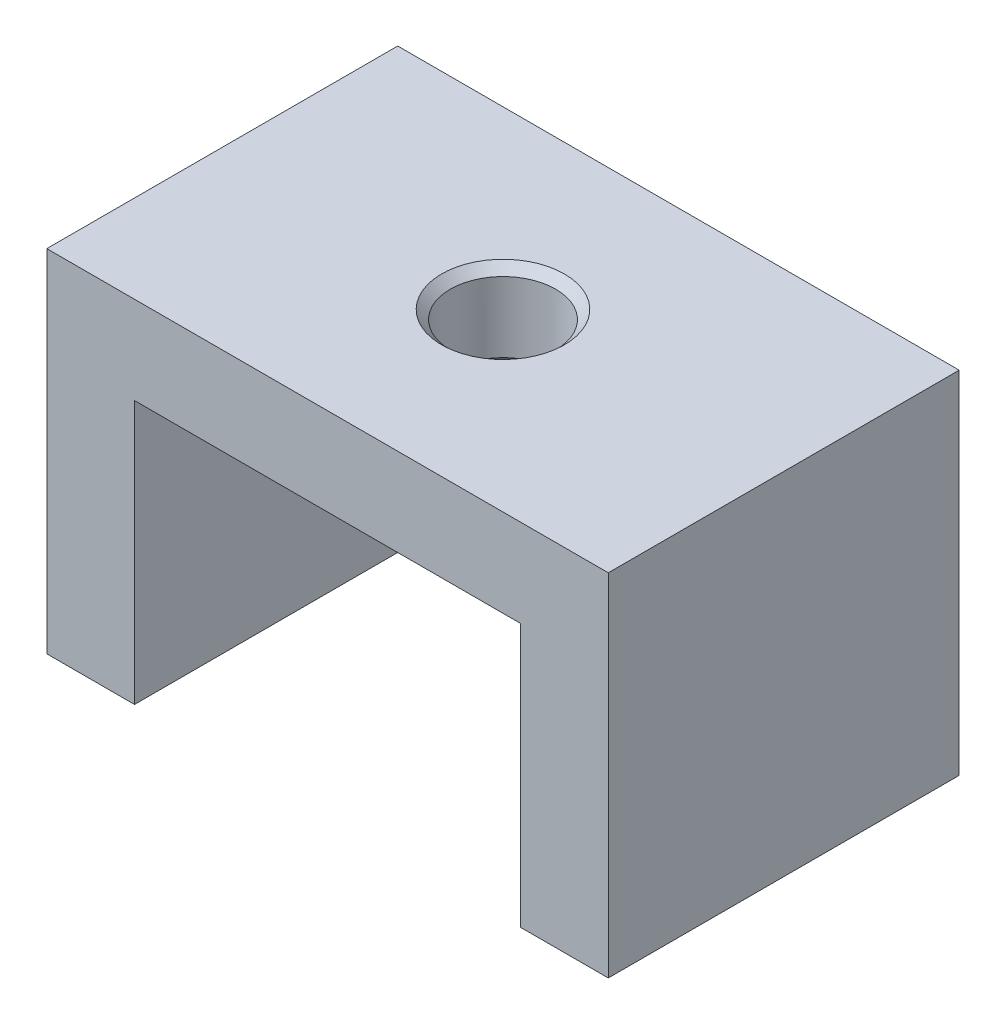
ISO-10303-21;
HEADER;
FILE_DESCRIPTION(('STEP AP214'),'2;1');
FILE_NAME('part.step','',(''),(''),'','','');
FILE_SCHEMA(('AUTOMOTIVE_DESIGN { 1 0 10303 214 1 1 1 1 }'));
ENDSEC;
DATA;
#1=APPLICATION_CONTEXT('core data for automotive mechanical design processes');
#2=APPLICATION_PROTOCOL_DEFINITION('international standard','automotive_design',2000,#1);
#3=PRODUCT_CONTEXT('',#1,'mechanical');
#4=PRODUCT('Part','Part','',(#3));
#5=PRODUCT_RELATED_PRODUCT_CATEGORY('part','',(#4));
#6=PRODUCT_DEFINITION_FORMATION('','',#4);
#7=PRODUCT_DEFINITION_CONTEXT('part definition',#1,'design');
#8=PRODUCT_DEFINITION('design','',#6,#7);
#9=PRODUCT_DEFINITION_SHAPE('','',#8);
#10=(LENGTH_UNIT() NAMED_UNIT(*) SI_UNIT(.MILLI.,.METRE.));
#11=(NAMED_UNIT(*) PLANE_ANGLE_UNIT() SI_UNIT($,.RADIAN.));
#12=(NAMED_UNIT(*) SI_UNIT($,.STERADIAN.) SOLID_ANGLE_UNIT());
#13=UNCERTAINTY_MEASURE_WITH_UNIT(LENGTH_MEASURE(1.E-05),#10,'distance_accuracy_value','');
#14=(GEOMETRIC_REPRESENTATION_CONTEXT(3) GLOBAL_UNCERTAINTY_ASSIGNED_CONTEXT((#13)) GLOBAL_UNIT_ASSIGNED_CONTEXT((#10,
#11,#12)) REPRESENTATION_CONTEXT('',''));
#15=CARTESIAN_POINT('',(0.,0.,0.));
#16=DIRECTION('',(0.,0.,1.));
#17=DIRECTION('',(1.,0.,0.));
#18=AXIS2_PLACEMENT_3D('',#15,#16,#17);
#19=CARTESIAN_POINT('',(-16.,20.,10.));
#20=DIRECTION('',(1.,0.,0.));
#21=DIRECTION('',(0.,1.,0.));
#22=AXIS2_PLACEMENT_3D('',#19,#20,#21);
#23=PLANE('',#22);
#24=DIRECTION('',(0.,-1.,0.));
#25=VECTOR('',#24,1.);
#26=CARTESIAN_POINT('',(-16.,20.,-10.));
#27=LINE('',#26,#25);
#28=CARTESIAN_POINT('',(-16.,20.,-10.));
#29=VERTEX_POINT('',#28);
#30=CARTESIAN_POINT('',(-16.,0.,-10.));
#31=VERTEX_POINT('',#30);
#32=EDGE_CURVE('E139',#29,#31,#27,.T.);
#33=ORIENTED_EDGE('',*,*,#32,.T.);
#34=DIRECTION('',(0.,0.,-1.));
#35=VECTOR('',#34,1.);
#36=CARTESIAN_POINT('',(-16.,0.,10.));
#37=LINE('',#36,#35);
#38=CARTESIAN_POINT('',(-16.,0.,10.));
#39=VERTEX_POINT('',#38);
#40=EDGE_CURVE('E167',#39,#31,#37,.T.);
#41=ORIENTED_EDGE('',*,*,#40,.F.);
#42=DIRECTION('',(0.,-1.,0.));
#43=VECTOR('',#42,1.);
#44=CARTESIAN_POINT('',(-16.,20.,10.));
#45=LINE('',#44,#43);
#46=CARTESIAN_POINT('',(-16.,20.,10.));
#47=VERTEX_POINT('',#46);
#48=EDGE_CURVE('E154',#47,#39,#45,.T.);
#49=ORIENTED_EDGE('',*,*,#48,.F.);
#50=DIRECTION('',(0.,0.,-1.));
#51=VECTOR('',#50,1.);
#52=CARTESIAN_POINT('',(-16.,20.,10.));
#53=LINE('',#52,#51);
#54=EDGE_CURVE('E135',#47,#29,#53,.T.);
#55=ORIENTED_EDGE('',*,*,#54,.T.);
#56=EDGE_LOOP('',(#33,#41,#49,#55));
#57=FACE_BOUND('',#56,.T.);
#58=ADVANCED_FACE('F38',(#57),#23,.F.);
#59=CARTESIAN_POINT('',(-16.,0.,10.));
#60=DIRECTION('',(0.,1.,0.));
#61=DIRECTION('',(-1.,0.,0.));
#62=AXIS2_PLACEMENT_3D('',#59,#60,#61);
#63=PLANE('',#62);
#64=CARTESIAN_POINT('',(-13.5,0.,-5.));
#65=DIRECTION('',(0.,-1.,0.));
#66=DIRECTION('',(0.,0.,-1.));
#67=AXIS2_PLACEMENT_3D('',#64,#65,#66);
#68=CIRCLE('',#67,1.65);
#69=CARTESIAN_POINT('',(-13.5,0.,-6.65));
#70=VERTEX_POINT('',#69);
#71=EDGE_CURVE('E261',#70,#70,#68,.T.);
#72=ORIENTED_EDGE('',*,*,#71,.F.);
#73=EDGE_LOOP('',(#72));
#74=FACE_BOUND('',#73,.T.);
#75=CARTESIAN_POINT('',(-13.5,0.,5.));
#76=DIRECTION('',(0.,-1.,0.));
#77=DIRECTION('',(0.,0.,-1.));
#78=AXIS2_PLACEMENT_3D('',#75,#76,#77);
#79=CIRCLE('',#78,1.65);
#80=CARTESIAN_POINT('',(-13.5,0.,3.35));
#81=VERTEX_POINT('',#80);
#82=EDGE_CURVE('E246',#81,#81,#79,.T.);
#83=ORIENTED_EDGE('',*,*,#82,.F.);
#84=EDGE_LOOP('',(#83));
#85=FACE_BOUND('',#84,.T.);
#86=DIRECTION('',(1.,0.,0.));
#87=VECTOR('',#86,1.);
#88=CARTESIAN_POINT('',(-16.,0.,-10.));
#89=LINE('',#88,#87);
#90=CARTESIAN_POINT('',(-11.,0.,-10.));
#91=VERTEX_POINT('',#90);
#92=EDGE_CURVE('E142',#31,#91,#89,.T.);
#93=ORIENTED_EDGE('',*,*,#92,.T.);
#94=DIRECTION('',(0.,0.,-1.));
#95=VECTOR('',#94,1.);
#96=CARTESIAN_POINT('',(-11.,0.,10.));
#97=LINE('',#96,#95);
#98=CARTESIAN_POINT('',(-11.,0.,10.));
#99=VERTEX_POINT('',#98);
#100=EDGE_CURVE('E164',#99,#91,#97,.T.);
#101=ORIENTED_EDGE('',*,*,#100,.F.);
#102=DIRECTION('',(1.,0.,0.));
#103=VECTOR('',#102,1.);
#104=CARTESIAN_POINT('',(-16.,0.,10.));
#105=LINE('',#104,#103);
#106=EDGE_CURVE('E100',#39,#99,#105,.T.);
#107=ORIENTED_EDGE('',*,*,#106,.F.);
#108=ORIENTED_EDGE('',*,*,#40,.T.);
#109=EDGE_LOOP('',(#93,#101,#107,#108));
#110=FACE_BOUND('',#109,.T.);
#111=ADVANCED_FACE('F216',(#74,#85,#110),#63,.F.);
#112=CARTESIAN_POINT('',(-11.,0.,10.));
#113=DIRECTION('',(-1.,0.,0.));
#114=DIRECTION('',(0.,0.,1.));
#115=AXIS2_PLACEMENT_3D('',#112,#113,#114);
#116=PLANE('',#115);
#117=DIRECTION('',(0.,1.,0.));
#118=VECTOR('',#117,1.);
#119=CARTESIAN_POINT('',(-11.,0.,-10.));
#120=LINE('',#119,#118);
#121=CARTESIAN_POINT('',(-11.,15.,-10.));
#122=VERTEX_POINT('',#121);
#123=EDGE_CURVE('E145',#91,#122,#120,.T.);
#124=ORIENTED_EDGE('',*,*,#123,.T.);
#125=DIRECTION('',(0.,0.,-1.));
#126=VECTOR('',#125,1.);
#127=CARTESIAN_POINT('',(-11.,15.,10.));
#128=LINE('',#127,#126);
#129=CARTESIAN_POINT('',(-11.,15.,10.));
#130=VERTEX_POINT('',#129);
#131=EDGE_CURVE('E161',#130,#122,#128,.T.);
#132=ORIENTED_EDGE('',*,*,#131,.F.);
#133=DIRECTION('',(0.,1.,0.));
#134=VECTOR('',#133,1.);
#135=CARTESIAN_POINT('',(-11.,0.,10.));
#136=LINE('',#135,#134);
#137=EDGE_CURVE('E252',#99,#130,#136,.T.);
#138=ORIENTED_EDGE('',*,*,#137,.F.);
#139=ORIENTED_EDGE('',*,*,#100,.T.);
#140=EDGE_LOOP('',(#124,#132,#138,#139));
#141=FACE_BOUND('',#140,.T.);
#142=ADVANCED_FACE('F189',(#141),#116,.F.);
#143=CARTESIAN_POINT('',(11.,15.,10.));
#144=DIRECTION('',(0.,1.,0.));
#145=DIRECTION('',(0.,0.,1.));
#146=AXIS2_PLACEMENT_3D('',#143,#144,#145);
#147=PLANE('',#146);
#148=CARTESIAN_POINT('',(0.,15.,0.));
#149=DIRECTION('',(0.,1.,0.));
#150=DIRECTION('',(0.,0.,1.));
#151=AXIS2_PLACEMENT_3D('',#148,#149,#150);
#152=CIRCLE('',#151,3.49999999999999);
#153=CARTESIAN_POINT('',(0.,15.,3.49999999999999));
#154=VERTEX_POINT('',#153);
#155=EDGE_CURVE('E169',#154,#154,#152,.T.);
#156=ORIENTED_EDGE('',*,*,#155,.T.);
#157=EDGE_LOOP('',(#156));
#158=FACE_BOUND('',#157,.T.);
#159=DIRECTION('',(1.,0.,0.));
#160=VECTOR('',#159,1.);
#161=CARTESIAN_POINT('',(11.,15.,-10.));
#162=LINE('',#161,#160);
#163=CARTESIAN_POINT('',(11.,15.,-10.));
#164=VERTEX_POINT('',#163);
#165=EDGE_CURVE('E147',#122,#164,#162,.T.);
#166=ORIENTED_EDGE('',*,*,#165,.T.);
#167=DIRECTION('',(0.,0.,-1.));
#168=VECTOR('',#167,1.);
#169=CARTESIAN_POINT('',(11.,15.,10.));
#170=LINE('',#169,#168);
#171=CARTESIAN_POINT('',(11.,15.,10.));
#172=VERTEX_POINT('',#171);
#173=EDGE_CURVE('E158',#172,#164,#170,.T.);
#174=ORIENTED_EDGE('',*,*,#173,.F.);
#175=DIRECTION('',(1.,0.,0.));
#176=VECTOR('',#175,1.);
#177=CARTESIAN_POINT('',(11.,15.,10.));
#178=LINE('',#177,#176);
#179=EDGE_CURVE('E254',#130,#172,#178,.T.);
#180=ORIENTED_EDGE('',*,*,#179,.F.);
#181=ORIENTED_EDGE('',*,*,#131,.T.);
#182=EDGE_LOOP('',(#166,#174,#180,#181));
#183=FACE_BOUND('',#182,.T.);
#184=ADVANCED_FACE('F185',(#158,#183),#147,.F.);
#185=CARTESIAN_POINT('',(11.,0.,10.));
#186=DIRECTION('',(1.,0.,0.));
#187=DIRECTION('',(0.,0.,-1.));
#188=AXIS2_PLACEMENT_3D('',#185,#186,#187);
#189=PLANE('',#188);
#190=DIRECTION('',(0.,-1.,0.));
#191=VECTOR('',#190,1.);
#192=CARTESIAN_POINT('',(11.,0.,-10.));
#193=LINE('',#192,#191);
#194=CARTESIAN_POINT('',(11.,0.,-10.));
#195=VERTEX_POINT('',#194);
#196=EDGE_CURVE('E149',#164,#195,#193,.T.);
#197=ORIENTED_EDGE('',*,*,#196,.T.);
#198=DIRECTION('',(0.,0.,-1.));
#199=VECTOR('',#198,1.);
#200=CARTESIAN_POINT('',(11.,0.,10.));
#201=LINE('',#200,#199);
#202=CARTESIAN_POINT('',(11.,0.,10.));
#203=VERTEX_POINT('',#202);
#204=EDGE_CURVE('E130',#203,#195,#201,.T.);
#205=ORIENTED_EDGE('',*,*,#204,.F.);
#206=DIRECTION('',(0.,-1.,0.));
#207=VECTOR('',#206,1.);
#208=CARTESIAN_POINT('',(11.,0.,10.));
#209=LINE('',#208,#207);
#210=EDGE_CURVE('E121',#172,#203,#209,.T.);
#211=ORIENTED_EDGE('',*,*,#210,.F.);
#212=ORIENTED_EDGE('',*,*,#173,.T.);
#213=EDGE_LOOP('',(#197,#205,#211,#212));
#214=FACE_BOUND('',#213,.T.);
#215=ADVANCED_FACE('F188',(#214),#189,.F.);
#216=CARTESIAN_POINT('',(16.,0.,10.));
#217=DIRECTION('',(0.,1.,0.));
#218=DIRECTION('',(-1.,0.,0.));
#219=AXIS2_PLACEMENT_3D('',#216,#217,#218);
#220=PLANE('',#219);
#221=CARTESIAN_POINT('',(13.5,0.,5.));
#222=DIRECTION('',(0.,-1.,0.));
#223=DIRECTION('',(0.,0.,-1.));
#224=AXIS2_PLACEMENT_3D('',#221,#222,#223);
#225=CIRCLE('',#224,1.65);
#226=CARTESIAN_POINT('',(13.5,0.,3.35));
#227=VERTEX_POINT('',#226);
#228=EDGE_CURVE('E236',#227,#227,#225,.T.);
#229=ORIENTED_EDGE('',*,*,#228,.F.);
#230=EDGE_LOOP('',(#229));
#231=FACE_BOUND('',#230,.T.);
#232=CARTESIAN_POINT('',(13.5,0.,-5.));
#233=DIRECTION('',(0.,-1.,0.));
#234=DIRECTION('',(0.,0.,-1.));
#235=AXIS2_PLACEMENT_3D('',#232,#233,#234);
#236=CIRCLE('',#235,1.65);
#237=CARTESIAN_POINT('',(13.5,0.,-6.65));
#238=VERTEX_POINT('',#237);
#239=EDGE_CURVE('E239',#238,#238,#236,.T.);
#240=ORIENTED_EDGE('',*,*,#239,.F.);
#241=EDGE_LOOP('',(#240));
#242=FACE_BOUND('',#241,.T.);
#243=DIRECTION('',(1.,0.,0.));
#244=VECTOR('',#243,1.);
#245=CARTESIAN_POINT('',(16.,0.,-10.));
#246=LINE('',#245,#244);
#247=CARTESIAN_POINT('',(16.,0.,-10.));
#248=VERTEX_POINT('',#247);
#249=EDGE_CURVE('E129',#195,#248,#246,.T.);
#250=ORIENTED_EDGE('',*,*,#249,.T.);
#251=DIRECTION('',(0.,0.,-1.));
#252=VECTOR('',#251,1.);
#253=CARTESIAN_POINT('',(16.,0.,10.));
#254=LINE('',#253,#252);
#255=CARTESIAN_POINT('',(16.,0.,10.));
#256=VERTEX_POINT('',#255);
#257=EDGE_CURVE('E126',#256,#248,#254,.T.);
#258=ORIENTED_EDGE('',*,*,#257,.F.);
#259=DIRECTION('',(1.,0.,0.));
#260=VECTOR('',#259,1.);
#261=CARTESIAN_POINT('',(16.,0.,10.));
#262=LINE('',#261,#260);
#263=EDGE_CURVE('E115',#203,#256,#262,.T.);
#264=ORIENTED_EDGE('',*,*,#263,.F.);
#265=ORIENTED_EDGE('',*,*,#204,.T.);
#266=EDGE_LOOP('',(#250,#258,#264,#265));
#267=FACE_BOUND('',#266,.T.);
#268=ADVANCED_FACE('F127',(#231,#242,#267),#220,.F.);
#269=CARTESIAN_POINT('',(16.,20.,10.));
#270=DIRECTION('',(-1.,0.,0.));
#271=DIRECTION('',(0.,-1.,0.));
#272=AXIS2_PLACEMENT_3D('',#269,#270,#271);
#273=PLANE('',#272);
#274=DIRECTION('',(0.,1.,0.));
#275=VECTOR('',#274,1.);
#276=CARTESIAN_POINT('',(16.,20.,-10.));
#277=LINE('',#276,#275);
#278=CARTESIAN_POINT('',(16.,20.,-10.));
#279=VERTEX_POINT('',#278);
#280=EDGE_CURVE('E85',#248,#279,#277,.T.);
#281=ORIENTED_EDGE('',*,*,#280,.T.);
#282=DIRECTION('',(0.,0.,-1.));
#283=VECTOR('',#282,1.);
#284=CARTESIAN_POINT('',(16.,20.,10.));
#285=LINE('',#284,#283);
#286=CARTESIAN_POINT('',(16.,20.,10.));
#287=VERTEX_POINT('',#286);
#288=EDGE_CURVE('E131',#287,#279,#285,.T.);
#289=ORIENTED_EDGE('',*,*,#288,.F.);
#290=DIRECTION('',(0.,1.,0.));
#291=VECTOR('',#290,1.);
#292=CARTESIAN_POINT('',(16.,20.,10.));
#293=LINE('',#292,#291);
#294=EDGE_CURVE('E119',#256,#287,#293,.T.);
#295=ORIENTED_EDGE('',*,*,#294,.F.);
#296=ORIENTED_EDGE('',*,*,#257,.T.);
#297=EDGE_LOOP('',(#281,#289,#295,#296));
#298=FACE_BOUND('',#297,.T.);
#299=ADVANCED_FACE('F133',(#298),#273,.F.);
#300=CARTESIAN_POINT('',(-16.,20.,10.));
#301=DIRECTION('',(0.,-1.,0.));
#302=DIRECTION('',(0.,0.,-1.));
#303=AXIS2_PLACEMENT_3D('',#300,#301,#302);
#304=PLANE('',#303);
#305=CARTESIAN_POINT('',(0.,20.,0.));
#306=DIRECTION('',(0.,-1.,0.));
#307=DIRECTION('',(0.,0.,-1.));
#308=AXIS2_PLACEMENT_3D('',#305,#306,#307);
#309=CIRCLE('',#308,3.50000000000003);
#310=CARTESIAN_POINT('',(0.,20.,-3.50000000000003));
#311=VERTEX_POINT('',#310);
#312=EDGE_CURVE('E11',#311,#311,#309,.T.);
#313=ORIENTED_EDGE('',*,*,#312,.T.);
#314=EDGE_LOOP('',(#313));
#315=FACE_BOUND('',#314,.T.);
#316=DIRECTION('',(-1.,0.,0.));
#317=VECTOR('',#316,1.);
#318=CARTESIAN_POINT('',(-16.,20.,-10.));
#319=LINE('',#318,#317);
#320=EDGE_CURVE('E91',#279,#29,#319,.T.);
#321=ORIENTED_EDGE('',*,*,#320,.T.);
#322=ORIENTED_EDGE('',*,*,#54,.F.);
#323=DIRECTION('',(-1.,0.,0.));
#324=VECTOR('',#323,1.);
#325=CARTESIAN_POINT('',(-16.,20.,10.));
#326=LINE('',#325,#324);
#327=EDGE_CURVE('E55',#287,#47,#326,.T.);
#328=ORIENTED_EDGE('',*,*,#327,.F.);
#329=ORIENTED_EDGE('',*,*,#288,.T.);
#330=EDGE_LOOP('',(#321,#322,#328,#329));
#331=FACE_BOUND('',#330,.T.);
#332=ADVANCED_FACE('F204',(#315,#331),#304,.F.);
#333=CARTESIAN_POINT('',(-16.,0.,10.));
#334=DIRECTION('',(0.,0.,1.));
#335=DIRECTION('',(1.,0.,0.));
#336=AXIS2_PLACEMENT_3D('',#333,#334,#335);
#337=PLANE('',#336);
#338=ORIENTED_EDGE('',*,*,#48,.T.);
#339=ORIENTED_EDGE('',*,*,#106,.T.);
#340=ORIENTED_EDGE('',*,*,#137,.T.);
#341=ORIENTED_EDGE('',*,*,#179,.T.);
#342=ORIENTED_EDGE('',*,*,#210,.T.);
#343=ORIENTED_EDGE('',*,*,#263,.T.);
#344=ORIENTED_EDGE('',*,*,#294,.T.);
#345=ORIENTED_EDGE('',*,*,#327,.T.);
#346=EDGE_LOOP('',(#338,#339,#340,#341,#342,#343,#344,#345));
#347=FACE_BOUND('',#346,.T.);
#348=ADVANCED_FACE('F117',(#347),#337,.T.);
#349=CARTESIAN_POINT('',(-16.,0.,-10.));
#350=DIRECTION('',(0.,0.,1.));
#351=DIRECTION('',(1.,0.,0.));
#352=AXIS2_PLACEMENT_3D('',#349,#350,#351);
#353=PLANE('',#352);
#354=ORIENTED_EDGE('',*,*,#32,.F.);
#355=ORIENTED_EDGE('',*,*,#320,.F.);
#356=ORIENTED_EDGE('',*,*,#280,.F.);
#357=ORIENTED_EDGE('',*,*,#249,.F.);
#358=ORIENTED_EDGE('',*,*,#196,.F.);
#359=ORIENTED_EDGE('',*,*,#165,.F.);
#360=ORIENTED_EDGE('',*,*,#123,.F.);
#361=ORIENTED_EDGE('',*,*,#92,.F.);
#362=EDGE_LOOP('',(#354,#355,#356,#357,#358,#359,#360,#361));
#363=FACE_BOUND('',#362,.T.);
#364=ADVANCED_FACE('F200',(#363),#353,.F.);
#365=CARTESIAN_POINT('',(0.,0.,0.));
#366=DIRECTION('',(0.,1.,0.));
#367=DIRECTION('',(0.,0.,1.));
#368=AXIS2_PLACEMENT_3D('',#365,#366,#367);
#369=CYLINDRICAL_SURFACE('',#368,3.);
#370=CARTESIAN_POINT('',(0.,15.5,0.));
#371=DIRECTION('',(0.,1.,0.));
#372=DIRECTION('',(0.,0.,1.));
#373=AXIS2_PLACEMENT_3D('',#370,#371,#372);
#374=CIRCLE('',#373,3.);
#375=CARTESIAN_POINT('',(0.,15.5,3.));
#376=VERTEX_POINT('',#375);
#377=EDGE_CURVE('E47',#376,#376,#374,.F.);
#378=ORIENTED_EDGE('',*,*,#377,.T.);
#379=EDGE_LOOP('',(#378));
#380=FACE_BOUND('',#379,.T.);
#381=CARTESIAN_POINT('',(0.,19.5,0.));
#382=DIRECTION('',(0.,-1.,0.));
#383=DIRECTION('',(0.,0.,-1.));
#384=AXIS2_PLACEMENT_3D('',#381,#382,#383);
#385=CIRCLE('',#384,3.);
#386=CARTESIAN_POINT('',(0.,19.5,-3.));
#387=VERTEX_POINT('',#386);
#388=EDGE_CURVE('E172',#387,#387,#385,.F.);
#389=ORIENTED_EDGE('',*,*,#388,.T.);
#390=EDGE_LOOP('',(#389));
#391=FACE_BOUND('',#390,.T.);
#392=ADVANCED_FACE('F177',(#380,#391),#369,.F.);
#393=CARTESIAN_POINT('',(0.,15.,0.));
#394=DIRECTION('',(0.,-1.,0.));
#395=DIRECTION('',(0.,0.,-1.));
#396=AXIS2_PLACEMENT_3D('',#393,#394,#395);
#397=CONICAL_SURFACE('',#396,3.49999999999999,0.785398163397447);
#398=ORIENTED_EDGE('',*,*,#377,.F.);
#399=EDGE_LOOP('',(#398));
#400=FACE_BOUND('',#399,.T.);
#401=ORIENTED_EDGE('',*,*,#155,.F.);
#402=EDGE_LOOP('',(#401));
#403=FACE_BOUND('',#402,.T.);
#404=ADVANCED_FACE('F180',(#400,#403),#397,.F.);
#405=CARTESIAN_POINT('',(0.,19.5,0.));
#406=DIRECTION('',(0.,1.,0.));
#407=DIRECTION('',(0.,0.,1.));
#408=AXIS2_PLACEMENT_3D('',#405,#406,#407);
#409=CONICAL_SURFACE('',#408,3.,0.78539816339745);
#410=ORIENTED_EDGE('',*,*,#312,.F.);
#411=EDGE_LOOP('',(#410));
#412=FACE_BOUND('',#411,.T.);
#413=ORIENTED_EDGE('',*,*,#388,.F.);
#414=EDGE_LOOP('',(#413));
#415=FACE_BOUND('',#414,.T.);
#416=ADVANCED_FACE('F40',(#412,#415),#409,.F.);
#417=CARTESIAN_POINT('',(13.5,10.1,-5.));
#418=DIRECTION('',(0.,-1.,0.));
#419=DIRECTION('',(0.,0.,-1.));
#420=AXIS2_PLACEMENT_3D('',#417,#418,#419);
#421=CONICAL_SURFACE('',#420,1.65,1.02974425867665);
#422=CARTESIAN_POINT('',(13.5,11.0914200213955,-5.));
#423=VERTEX_POINT('',#422);
#424=VERTEX_LOOP('',#423);
#425=FACE_BOUND('',#424,.T.);
#426=CARTESIAN_POINT('',(13.5,10.1,-5.));
#427=DIRECTION('',(0.,-1.,0.));
#428=DIRECTION('',(0.,0.,-1.));
#429=AXIS2_PLACEMENT_3D('',#426,#427,#428);
#430=CIRCLE('',#429,1.65);
#431=CARTESIAN_POINT('',(13.5,10.1,-6.65));
#432=VERTEX_POINT('',#431);
#433=EDGE_CURVE('E143',#432,#432,#430,.T.);
#434=ORIENTED_EDGE('',*,*,#433,.T.);
#435=EDGE_LOOP('',(#434));
#436=FACE_BOUND('',#435,.T.);
#437=ADVANCED_FACE('F299',(#425,#436),#421,.F.);
#438=CARTESIAN_POINT('',(13.5,0.,-5.));
#439=DIRECTION('',(0.,-1.,0.));
#440=DIRECTION('',(0.,0.,-1.));
#441=AXIS2_PLACEMENT_3D('',#438,#439,#440);
#442=CYLINDRICAL_SURFACE('',#441,1.65);
#443=ORIENTED_EDGE('',*,*,#433,.F.);
#444=EDGE_LOOP('',(#443));
#445=FACE_BOUND('',#444,.T.);
#446=ORIENTED_EDGE('',*,*,#239,.T.);
#447=EDGE_LOOP('',(#446));
#448=FACE_BOUND('',#447,.T.);
#449=ADVANCED_FACE('F295',(#445,#448),#442,.F.);
#450=CARTESIAN_POINT('',(-13.5,10.1,5.));
#451=DIRECTION('',(0.,-1.,0.));
#452=DIRECTION('',(0.,0.,-1.));
#453=AXIS2_PLACEMENT_3D('',#450,#451,#452);
#454=CONICAL_SURFACE('',#453,1.65,1.02974425867665);
#455=CARTESIAN_POINT('',(-13.5,11.0914200213955,5.));
#456=VERTEX_POINT('',#455);
#457=VERTEX_LOOP('',#456);
#458=FACE_BOUND('',#457,.T.);
#459=CARTESIAN_POINT('',(-13.5,10.1,5.));
#460=DIRECTION('',(0.,-1.,0.));
#461=DIRECTION('',(0.,0.,-1.));
#462=AXIS2_PLACEMENT_3D('',#459,#460,#461);
#463=CIRCLE('',#462,1.65);
#464=CARTESIAN_POINT('',(-13.5,10.1,3.35));
#465=VERTEX_POINT('',#464);
#466=EDGE_CURVE('E241',#465,#465,#463,.T.);
#467=ORIENTED_EDGE('',*,*,#466,.T.);
#468=EDGE_LOOP('',(#467));
#469=FACE_BOUND('',#468,.T.);
#470=ADVANCED_FACE('F291',(#458,#469),#454,.F.);
#471=CARTESIAN_POINT('',(-13.5,0.,5.));
#472=DIRECTION('',(0.,-1.,0.));
#473=DIRECTION('',(0.,0.,-1.));
#474=AXIS2_PLACEMENT_3D('',#471,#472,#473);
#475=CYLINDRICAL_SURFACE('',#474,1.65);
#476=ORIENTED_EDGE('',*,*,#466,.F.);
#477=EDGE_LOOP('',(#476));
#478=FACE_BOUND('',#477,.T.);
#479=ORIENTED_EDGE('',*,*,#82,.T.);
#480=EDGE_LOOP('',(#479));
#481=FACE_BOUND('',#480,.T.);
#482=ADVANCED_FACE('F287',(#478,#481),#475,.F.);
#483=CARTESIAN_POINT('',(-13.5,10.1,-5.));
#484=DIRECTION('',(0.,-1.,0.));
#485=DIRECTION('',(0.,0.,-1.));
#486=AXIS2_PLACEMENT_3D('',#483,#484,#485);
#487=CONICAL_SURFACE('',#486,1.65,1.02974425867665);
#488=CARTESIAN_POINT('',(-13.5,11.0914200213955,-5.));
#489=VERTEX_POINT('',#488);
#490=VERTEX_LOOP('',#489);
#491=FACE_BOUND('',#490,.T.);
#492=CARTESIAN_POINT('',(-13.5,10.1,-5.));
#493=DIRECTION('',(0.,-1.,0.));
#494=DIRECTION('',(0.,0.,-1.));
#495=AXIS2_PLACEMENT_3D('',#492,#493,#494);
#496=CIRCLE('',#495,1.65);
#497=CARTESIAN_POINT('',(-13.5,10.1,-6.65));
#498=VERTEX_POINT('',#497);
#499=EDGE_CURVE('E258',#498,#498,#496,.T.);
#500=ORIENTED_EDGE('',*,*,#499,.T.);
#501=EDGE_LOOP('',(#500));
#502=FACE_BOUND('',#501,.T.);
#503=ADVANCED_FACE('F283',(#491,#502),#487,.F.);
#504=CARTESIAN_POINT('',(-13.5,0.,-5.));
#505=DIRECTION('',(0.,-1.,0.));
#506=DIRECTION('',(0.,0.,-1.));
#507=AXIS2_PLACEMENT_3D('',#504,#505,#506);
#508=CYLINDRICAL_SURFACE('',#507,1.65);
#509=ORIENTED_EDGE('',*,*,#499,.F.);
#510=EDGE_LOOP('',(#509));
#511=FACE_BOUND('',#510,.T.);
#512=ORIENTED_EDGE('',*,*,#71,.T.);
#513=EDGE_LOOP('',(#512));
#514=FACE_BOUND('',#513,.T.);
#515=ADVANCED_FACE('F276',(#511,#514),#508,.F.);
#516=CARTESIAN_POINT('',(13.5,10.1,5.));
#517=DIRECTION('',(0.,-1.,0.));
#518=DIRECTION('',(0.,0.,-1.));
#519=AXIS2_PLACEMENT_3D('',#516,#517,#518);
#520=CONICAL_SURFACE('',#519,1.65,1.02974425867665);
#521=CARTESIAN_POINT('',(13.5,11.0914200213955,5.));
#522=VERTEX_POINT('',#521);
#523=VERTEX_LOOP('',#522);
#524=FACE_BOUND('',#523,.T.);
#525=CARTESIAN_POINT('',(13.5,10.1,5.));
#526=DIRECTION('',(0.,-1.,0.));
#527=DIRECTION('',(0.,0.,-1.));
#528=AXIS2_PLACEMENT_3D('',#525,#526,#527);
#529=CIRCLE('',#528,1.65);
#530=CARTESIAN_POINT('',(13.5,10.1,3.35));
#531=VERTEX_POINT('',#530);
#532=EDGE_CURVE('E264',#531,#531,#529,.T.);
#533=ORIENTED_EDGE('',*,*,#532,.T.);
#534=EDGE_LOOP('',(#533));
#535=FACE_BOUND('',#534,.T.);
#536=ADVANCED_FACE('F270',(#524,#535),#520,.F.);
#537=CARTESIAN_POINT('',(13.5,0.,5.));
#538=DIRECTION('',(0.,-1.,0.));
#539=DIRECTION('',(0.,0.,-1.));
#540=AXIS2_PLACEMENT_3D('',#537,#538,#539);
#541=CYLINDRICAL_SURFACE('',#540,1.65);
#542=ORIENTED_EDGE('',*,*,#532,.F.);
#543=EDGE_LOOP('',(#542));
#544=FACE_BOUND('',#543,.T.);
#545=ORIENTED_EDGE('',*,*,#228,.T.);
#546=EDGE_LOOP('',(#545));
#547=FACE_BOUND('',#546,.T.);
#548=ADVANCED_FACE('F268',(#544,#547),#541,.F.);
#549=CLOSED_SHELL('',(#58,#111,#142,#184,#215,#268,#299,#332,#348,#364,#392,#404,#416,#437,#449,
#470,#482,#503,#515,#536,#548));
#550=MANIFOLD_SOLID_BREP('B2',#549);
#551=ADVANCED_BREP_SHAPE_REPRESENTATION('',(#18,#550),#14);
#552=SHAPE_DEFINITION_REPRESENTATION(#9,#551);
ENDSEC;
END-ISO-10303-21;
